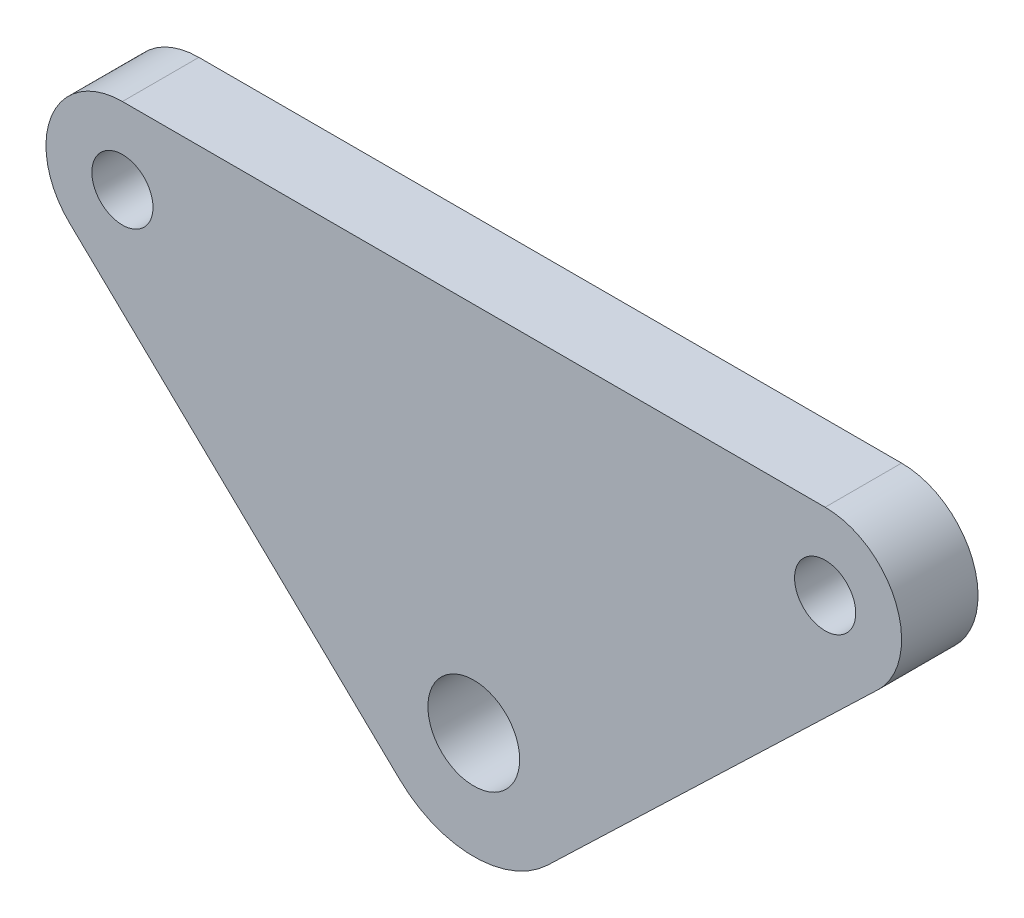
ISO-10303-21;
HEADER;
FILE_DESCRIPTION(('STEP AP214'),'2;1');
FILE_NAME('part.step','',(''),(''),'','','');
FILE_SCHEMA(('AUTOMOTIVE_DESIGN { 1 0 10303 214 1 1 1 1 }'));
ENDSEC;
DATA;
#1=APPLICATION_CONTEXT('core data for automotive mechanical design processes');
#2=APPLICATION_PROTOCOL_DEFINITION('international standard','automotive_design',2000,#1);
#3=PRODUCT_CONTEXT('',#1,'mechanical');
#4=PRODUCT('Part','Part','',(#3));
#5=PRODUCT_RELATED_PRODUCT_CATEGORY('part','',(#4));
#6=PRODUCT_DEFINITION_FORMATION('','',#4);
#7=PRODUCT_DEFINITION_CONTEXT('part definition',#1,'design');
#8=PRODUCT_DEFINITION('design','',#6,#7);
#9=PRODUCT_DEFINITION_SHAPE('','',#8);
#10=(LENGTH_UNIT() NAMED_UNIT(*) SI_UNIT(.MILLI.,.METRE.));
#11=(NAMED_UNIT(*) PLANE_ANGLE_UNIT() SI_UNIT($,.RADIAN.));
#12=(NAMED_UNIT(*) SI_UNIT($,.STERADIAN.) SOLID_ANGLE_UNIT());
#13=UNCERTAINTY_MEASURE_WITH_UNIT(LENGTH_MEASURE(1.E-05),#10,'distance_accuracy_value','');
#14=(GEOMETRIC_REPRESENTATION_CONTEXT(3) GLOBAL_UNCERTAINTY_ASSIGNED_CONTEXT((#13)) GLOBAL_UNIT_ASSIGNED_CONTEXT((#10,
#11,#12)) REPRESENTATION_CONTEXT('',''));
#15=CARTESIAN_POINT('',(0.,0.,0.));
#16=DIRECTION('',(0.,0.,1.));
#17=DIRECTION('',(1.,0.,0.));
#18=AXIS2_PLACEMENT_3D('',#15,#16,#17);
#19=CARTESIAN_POINT('',(-125.350212024943,156.268923770409,-15.));
#20=DIRECTION('',(0.,0.,1.));
#21=DIRECTION('',(1.,0.,0.));
#22=AXIS2_PLACEMENT_3D('',#19,#20,#21);
#23=CYLINDRICAL_SURFACE('',#22,5.00000000000001);
#24=CARTESIAN_POINT('',(-125.350212024943,156.268923770409,-10.));
#25=DIRECTION('',(0.,0.,1.));
#26=DIRECTION('',(1.,0.,0.));
#27=AXIS2_PLACEMENT_3D('',#24,#25,#26);
#28=CIRCLE('',#27,5.00000000000001);
#29=CARTESIAN_POINT('',(-125.350212024943,161.268923770409,-10.));
#30=VERTEX_POINT('',#29);
#31=CARTESIAN_POINT('',(-128.812348183196,152.661485174713,-10.));
#32=VERTEX_POINT('',#31);
#33=EDGE_CURVE('E118',#30,#32,#28,.T.);
#34=ORIENTED_EDGE('',*,*,#33,.F.);
#35=DIRECTION('',(0.,0.,1.));
#36=VECTOR('',#35,1.);
#37=CARTESIAN_POINT('',(-125.350212024943,161.268923770409,-15.));
#38=LINE('',#37,#36);
#39=CARTESIAN_POINT('',(-125.350212024943,161.268923770409,-15.));
#40=VERTEX_POINT('',#39);
#41=EDGE_CURVE('E11',#40,#30,#38,.T.);
#42=ORIENTED_EDGE('',*,*,#41,.F.);
#43=CARTESIAN_POINT('',(-125.350212024943,156.268923770409,-15.));
#44=DIRECTION('',(0.,0.,1.));
#45=DIRECTION('',(1.,0.,0.));
#46=AXIS2_PLACEMENT_3D('',#43,#44,#45);
#47=CIRCLE('',#46,5.00000000000001);
#48=CARTESIAN_POINT('',(-128.812348183196,152.661485174713,-15.));
#49=VERTEX_POINT('',#48);
#50=EDGE_CURVE('E133',#40,#49,#47,.T.);
#51=ORIENTED_EDGE('',*,*,#50,.T.);
#52=DIRECTION('',(0.,0.,1.));
#53=VECTOR('',#52,1.);
#54=CARTESIAN_POINT('',(-128.812348183196,152.661485174713,-15.));
#55=LINE('',#54,#53);
#56=EDGE_CURVE('E36',#49,#32,#55,.T.);
#57=ORIENTED_EDGE('',*,*,#56,.T.);
#58=EDGE_LOOP('',(#34,#42,#51,#57));
#59=FACE_BOUND('',#58,.T.);
#60=ADVANCED_FACE('F33',(#59),#23,.T.);
#61=CARTESIAN_POINT('',(-125.350212024943,161.268923770409,-15.));
#62=DIRECTION('',(0.,1.,0.));
#63=DIRECTION('',(-1.,0.,0.));
#64=AXIS2_PLACEMENT_3D('',#61,#62,#63);
#65=PLANE('',#64);
#66=DIRECTION('',(-1.,0.,0.));
#67=VECTOR('',#66,1.);
#68=CARTESIAN_POINT('',(-125.350212024943,161.268923770409,-10.));
#69=LINE('',#68,#67);
#70=CARTESIAN_POINT('',(-79.3875454378039,161.268923770408,-10.));
#71=VERTEX_POINT('',#70);
#72=EDGE_CURVE('E131',#71,#30,#69,.T.);
#73=ORIENTED_EDGE('',*,*,#72,.F.);
#74=DIRECTION('',(0.,0.,1.));
#75=VECTOR('',#74,1.);
#76=CARTESIAN_POINT('',(-79.3875454378039,161.268923770408,-15.));
#77=LINE('',#76,#75);
#78=CARTESIAN_POINT('',(-79.3875454378039,161.268923770408,-15.));
#79=VERTEX_POINT('',#78);
#80=EDGE_CURVE('E42',#79,#71,#77,.T.);
#81=ORIENTED_EDGE('',*,*,#80,.F.);
#82=DIRECTION('',(-1.,0.,0.));
#83=VECTOR('',#82,1.);
#84=CARTESIAN_POINT('',(-125.350212024943,161.268923770409,-15.));
#85=LINE('',#84,#83);
#86=EDGE_CURVE('E108',#79,#40,#85,.T.);
#87=ORIENTED_EDGE('',*,*,#86,.T.);
#88=ORIENTED_EDGE('',*,*,#41,.T.);
#89=EDGE_LOOP('',(#73,#81,#87,#88));
#90=FACE_BOUND('',#89,.T.);
#91=ADVANCED_FACE('F141',(#90),#65,.T.);
#92=CARTESIAN_POINT('',(-79.3875454378039,156.268923770408,-15.));
#93=DIRECTION('',(0.,0.,1.));
#94=DIRECTION('',(1.,0.,0.));
#95=AXIS2_PLACEMENT_3D('',#92,#93,#94);
#96=CYLINDRICAL_SURFACE('',#95,4.99999999999998);
#97=CARTESIAN_POINT('',(-79.3875454378039,156.268923770408,-10.));
#98=DIRECTION('',(0.,0.,1.));
#99=DIRECTION('',(1.,0.,0.));
#100=AXIS2_PLACEMENT_3D('',#97,#98,#99);
#101=CIRCLE('',#100,4.99999999999998);
#102=CARTESIAN_POINT('',(-75.9254092795504,152.661485174713,-10.));
#103=VERTEX_POINT('',#102);
#104=EDGE_CURVE('E95',#103,#71,#101,.T.);
#105=ORIENTED_EDGE('',*,*,#104,.F.);
#106=DIRECTION('',(0.,0.,1.));
#107=VECTOR('',#106,1.);
#108=CARTESIAN_POINT('',(-75.9254092795504,152.661485174713,-15.));
#109=LINE('',#108,#107);
#110=CARTESIAN_POINT('',(-75.9254092795504,152.661485174713,-15.));
#111=VERTEX_POINT('',#110);
#112=EDGE_CURVE('E90',#111,#103,#109,.T.);
#113=ORIENTED_EDGE('',*,*,#112,.F.);
#114=CARTESIAN_POINT('',(-79.3875454378039,156.268923770408,-15.));
#115=DIRECTION('',(0.,0.,1.));
#116=DIRECTION('',(1.,0.,0.));
#117=AXIS2_PLACEMENT_3D('',#114,#115,#116);
#118=CIRCLE('',#117,4.99999999999998);
#119=EDGE_CURVE('E93',#111,#79,#118,.T.);
#120=ORIENTED_EDGE('',*,*,#119,.T.);
#121=ORIENTED_EDGE('',*,*,#80,.T.);
#122=EDGE_LOOP('',(#105,#113,#120,#121));
#123=FACE_BOUND('',#122,.T.);
#124=ADVANCED_FACE('F92',(#123),#96,.T.);
#125=CARTESIAN_POINT('',(-75.9254092795504,152.661485174713,-15.));
#126=DIRECTION('',(0.692427231650704,-0.721487719139101,0.));
#127=DIRECTION('',(0.721487719139101,0.692427231650704,0.));
#128=AXIS2_PLACEMENT_3D('',#125,#126,#127);
#129=PLANE('',#128);
#130=DIRECTION('',(0.721487719139101,0.692427231650704,0.));
#131=VECTOR('',#130,1.);
#132=CARTESIAN_POINT('',(-75.9254092795504,152.661485174713,-10.));
#133=LINE('',#132,#131);
#134=CARTESIAN_POINT('',(-97.5218881098184,131.934881445839,-10.));
#135=VERTEX_POINT('',#134);
#136=EDGE_CURVE('E128',#135,#103,#133,.T.);
#137=ORIENTED_EDGE('',*,*,#136,.F.);
#138=DIRECTION('',(0.,0.,1.));
#139=VECTOR('',#138,1.);
#140=CARTESIAN_POINT('',(-97.5218881098184,131.934881445839,-15.));
#141=LINE('',#140,#139);
#142=CARTESIAN_POINT('',(-97.5218881098184,131.934881445839,-15.));
#143=VERTEX_POINT('',#142);
#144=EDGE_CURVE('E100',#143,#135,#141,.T.);
#145=ORIENTED_EDGE('',*,*,#144,.F.);
#146=DIRECTION('',(0.721487719139101,0.692427231650704,0.));
#147=VECTOR('',#146,1.);
#148=CARTESIAN_POINT('',(-75.9254092795504,152.661485174713,-15.));
#149=LINE('',#148,#147);
#150=EDGE_CURVE('E106',#143,#111,#149,.T.);
#151=ORIENTED_EDGE('',*,*,#150,.T.);
#152=ORIENTED_EDGE('',*,*,#112,.T.);
#153=EDGE_LOOP('',(#137,#145,#151,#152));
#154=FACE_BOUND('',#153,.T.);
#155=ADVANCED_FACE('F110',(#154),#129,.T.);
#156=CARTESIAN_POINT('',(-102.368878731373,136.985295479812,-15.));
#157=DIRECTION('',(0.,0.,1.));
#158=DIRECTION('',(1.,0.,0.));
#159=AXIS2_PLACEMENT_3D('',#156,#157,#158);
#160=CYLINDRICAL_SURFACE('',#159,7.00000000000001);
#161=CARTESIAN_POINT('',(-102.368878731373,136.985295479812,-10.));
#162=DIRECTION('',(0.,0.,1.));
#163=DIRECTION('',(1.,0.,0.));
#164=AXIS2_PLACEMENT_3D('',#161,#162,#163);
#165=CIRCLE('',#164,7.00000000000001);
#166=CARTESIAN_POINT('',(-107.215869352928,131.934881445839,-10.));
#167=VERTEX_POINT('',#166);
#168=EDGE_CURVE('E125',#167,#135,#165,.T.);
#169=ORIENTED_EDGE('',*,*,#168,.F.);
#170=DIRECTION('',(0.,0.,1.));
#171=VECTOR('',#170,1.);
#172=CARTESIAN_POINT('',(-107.215869352928,131.934881445839,-15.));
#173=LINE('',#172,#171);
#174=CARTESIAN_POINT('',(-107.215869352928,131.934881445839,-15.));
#175=VERTEX_POINT('',#174);
#176=EDGE_CURVE('E136',#175,#167,#173,.T.);
#177=ORIENTED_EDGE('',*,*,#176,.F.);
#178=CARTESIAN_POINT('',(-102.368878731373,136.985295479812,-15.));
#179=DIRECTION('',(0.,0.,1.));
#180=DIRECTION('',(1.,0.,0.));
#181=AXIS2_PLACEMENT_3D('',#178,#179,#180);
#182=CIRCLE('',#181,7.00000000000001);
#183=EDGE_CURVE('E111',#175,#143,#182,.T.);
#184=ORIENTED_EDGE('',*,*,#183,.T.);
#185=ORIENTED_EDGE('',*,*,#144,.T.);
#186=EDGE_LOOP('',(#169,#177,#184,#185));
#187=FACE_BOUND('',#186,.T.);
#188=ADVANCED_FACE('F154',(#187),#160,.T.);
#189=CARTESIAN_POINT('',(-128.812348183196,152.661485174713,-15.));
#190=DIRECTION('',(-0.692427231650708,-0.721487719139097,0.));
#191=DIRECTION('',(0.721487719139097,-0.692427231650708,0.));
#192=AXIS2_PLACEMENT_3D('',#189,#190,#191);
#193=PLANE('',#192);
#194=DIRECTION('',(0.721487719139097,-0.692427231650708,0.));
#195=VECTOR('',#194,1.);
#196=CARTESIAN_POINT('',(-128.812348183196,152.661485174713,-10.));
#197=LINE('',#196,#195);
#198=EDGE_CURVE('E121',#32,#167,#197,.T.);
#199=ORIENTED_EDGE('',*,*,#198,.F.);
#200=ORIENTED_EDGE('',*,*,#56,.F.);
#201=DIRECTION('',(0.721487719139097,-0.692427231650708,0.));
#202=VECTOR('',#201,1.);
#203=CARTESIAN_POINT('',(-128.812348183196,152.661485174713,-15.));
#204=LINE('',#203,#202);
#205=EDGE_CURVE('E113',#49,#175,#204,.T.);
#206=ORIENTED_EDGE('',*,*,#205,.T.);
#207=ORIENTED_EDGE('',*,*,#176,.T.);
#208=EDGE_LOOP('',(#199,#200,#206,#207));
#209=FACE_BOUND('',#208,.T.);
#210=ADVANCED_FACE('F138',(#209),#193,.T.);
#211=CARTESIAN_POINT('',(-125.350212024943,156.268923770409,-15.));
#212=DIRECTION('',(0.,0.,1.));
#213=DIRECTION('',(1.,0.,0.));
#214=AXIS2_PLACEMENT_3D('',#211,#212,#213);
#215=PLANE('',#214);
#216=CARTESIAN_POINT('',(-125.350212024943,156.268923770409,-15.));
#217=DIRECTION('',(0.,0.,1.));
#218=DIRECTION('',(1.,0.,0.));
#219=AXIS2_PLACEMENT_3D('',#216,#217,#218);
#220=CIRCLE('',#219,2.);
#221=CARTESIAN_POINT('',(-123.350212024943,156.268923770409,-15.));
#222=VERTEX_POINT('',#221);
#223=EDGE_CURVE('E184',#222,#222,#220,.T.);
#224=ORIENTED_EDGE('',*,*,#223,.T.);
#225=EDGE_LOOP('',(#224));
#226=FACE_BOUND('',#225,.T.);
#227=CARTESIAN_POINT('',(-79.3875454378039,156.268923770408,-15.));
#228=DIRECTION('',(0.,0.,1.));
#229=DIRECTION('',(1.,0.,0.));
#230=AXIS2_PLACEMENT_3D('',#227,#228,#229);
#231=CIRCLE('',#230,2.00000000000124);
#232=CARTESIAN_POINT('',(-77.3875454378027,156.268923770408,-15.));
#233=VERTEX_POINT('',#232);
#234=EDGE_CURVE('E192',#233,#233,#231,.T.);
#235=ORIENTED_EDGE('',*,*,#234,.T.);
#236=EDGE_LOOP('',(#235));
#237=FACE_BOUND('',#236,.T.);
#238=CARTESIAN_POINT('',(-102.368878731373,136.985295479812,-15.));
#239=DIRECTION('',(0.,0.,1.));
#240=DIRECTION('',(1.,0.,0.));
#241=AXIS2_PLACEMENT_3D('',#238,#239,#240);
#242=CIRCLE('',#241,3.00000000000115);
#243=CARTESIAN_POINT('',(-99.3688787313722,136.985295479812,-15.));
#244=VERTEX_POINT('',#243);
#245=EDGE_CURVE('E122',#244,#244,#242,.T.);
#246=ORIENTED_EDGE('',*,*,#245,.T.);
#247=EDGE_LOOP('',(#246));
#248=FACE_BOUND('',#247,.T.);
#249=ORIENTED_EDGE('',*,*,#50,.F.);
#250=ORIENTED_EDGE('',*,*,#86,.F.);
#251=ORIENTED_EDGE('',*,*,#119,.F.);
#252=ORIENTED_EDGE('',*,*,#150,.F.);
#253=ORIENTED_EDGE('',*,*,#183,.F.);
#254=ORIENTED_EDGE('',*,*,#205,.F.);
#255=EDGE_LOOP('',(#249,#250,#251,#252,#253,#254));
#256=FACE_BOUND('',#255,.T.);
#257=ADVANCED_FACE('F104',(#226,#237,#248,#256),#215,.F.);
#258=CARTESIAN_POINT('',(-125.350212024943,156.268923770409,-10.));
#259=DIRECTION('',(0.,0.,1.));
#260=DIRECTION('',(1.,0.,0.));
#261=AXIS2_PLACEMENT_3D('',#258,#259,#260);
#262=PLANE('',#261);
#263=CARTESIAN_POINT('',(-125.350212024943,156.268923770409,-10.));
#264=DIRECTION('',(0.,0.,1.));
#265=DIRECTION('',(1.,0.,0.));
#266=AXIS2_PLACEMENT_3D('',#263,#264,#265);
#267=CIRCLE('',#266,2.);
#268=CARTESIAN_POINT('',(-123.350212024943,156.268923770409,-10.));
#269=VERTEX_POINT('',#268);
#270=EDGE_CURVE('E187',#269,#269,#267,.T.);
#271=ORIENTED_EDGE('',*,*,#270,.F.);
#272=EDGE_LOOP('',(#271));
#273=FACE_BOUND('',#272,.T.);
#274=CARTESIAN_POINT('',(-79.3875454378039,156.268923770408,-10.));
#275=DIRECTION('',(0.,0.,1.));
#276=DIRECTION('',(1.,0.,0.));
#277=AXIS2_PLACEMENT_3D('',#274,#275,#276);
#278=CIRCLE('',#277,2.00000000000124);
#279=CARTESIAN_POINT('',(-77.3875454378027,156.268923770408,-10.));
#280=VERTEX_POINT('',#279);
#281=EDGE_CURVE('E189',#280,#280,#278,.T.);
#282=ORIENTED_EDGE('',*,*,#281,.F.);
#283=EDGE_LOOP('',(#282));
#284=FACE_BOUND('',#283,.T.);
#285=CARTESIAN_POINT('',(-102.368878731373,136.985295479812,-10.));
#286=DIRECTION('',(0.,0.,1.));
#287=DIRECTION('',(1.,0.,0.));
#288=AXIS2_PLACEMENT_3D('',#285,#286,#287);
#289=CIRCLE('',#288,3.00000000000115);
#290=CARTESIAN_POINT('',(-99.3688787313722,136.985295479812,-10.));
#291=VERTEX_POINT('',#290);
#292=EDGE_CURVE('E195',#291,#291,#289,.T.);
#293=ORIENTED_EDGE('',*,*,#292,.F.);
#294=EDGE_LOOP('',(#293));
#295=FACE_BOUND('',#294,.T.);
#296=ORIENTED_EDGE('',*,*,#33,.T.);
#297=ORIENTED_EDGE('',*,*,#198,.T.);
#298=ORIENTED_EDGE('',*,*,#168,.T.);
#299=ORIENTED_EDGE('',*,*,#136,.T.);
#300=ORIENTED_EDGE('',*,*,#104,.T.);
#301=ORIENTED_EDGE('',*,*,#72,.T.);
#302=EDGE_LOOP('',(#296,#297,#298,#299,#300,#301));
#303=FACE_BOUND('',#302,.T.);
#304=ADVANCED_FACE('F140',(#273,#284,#295,#303),#262,.T.);
#305=CARTESIAN_POINT('',(-102.368878731373,136.985295479812,-15.));
#306=DIRECTION('',(0.,0.,1.));
#307=DIRECTION('',(1.,0.,0.));
#308=AXIS2_PLACEMENT_3D('',#305,#306,#307);
#309=CYLINDRICAL_SURFACE('',#308,3.00000000000115);
#310=ORIENTED_EDGE('',*,*,#245,.F.);
#311=EDGE_LOOP('',(#310));
#312=FACE_BOUND('',#311,.T.);
#313=ORIENTED_EDGE('',*,*,#292,.T.);
#314=EDGE_LOOP('',(#313));
#315=FACE_BOUND('',#314,.T.);
#316=ADVANCED_FACE('F165',(#312,#315),#309,.F.);
#317=CARTESIAN_POINT('',(-79.3875454378039,156.268923770408,-15.));
#318=DIRECTION('',(0.,0.,1.));
#319=DIRECTION('',(1.,0.,0.));
#320=AXIS2_PLACEMENT_3D('',#317,#318,#319);
#321=CYLINDRICAL_SURFACE('',#320,2.00000000000124);
#322=ORIENTED_EDGE('',*,*,#234,.F.);
#323=EDGE_LOOP('',(#322));
#324=FACE_BOUND('',#323,.T.);
#325=ORIENTED_EDGE('',*,*,#281,.T.);
#326=EDGE_LOOP('',(#325));
#327=FACE_BOUND('',#326,.T.);
#328=ADVANCED_FACE('F172',(#324,#327),#321,.F.);
#329=CARTESIAN_POINT('',(-125.350212024943,156.268923770409,-15.));
#330=DIRECTION('',(0.,0.,1.));
#331=DIRECTION('',(1.,0.,0.));
#332=AXIS2_PLACEMENT_3D('',#329,#330,#331);
#333=CYLINDRICAL_SURFACE('',#332,2.);
#334=ORIENTED_EDGE('',*,*,#223,.F.);
#335=EDGE_LOOP('',(#334));
#336=FACE_BOUND('',#335,.T.);
#337=ORIENTED_EDGE('',*,*,#270,.T.);
#338=EDGE_LOOP('',(#337));
#339=FACE_BOUND('',#338,.T.);
#340=ADVANCED_FACE('F176',(#336,#339),#333,.F.);
#341=CLOSED_SHELL('',(#60,#91,#124,#155,#188,#210,#257,#304,#316,#328,#340));
#342=MANIFOLD_SOLID_BREP('B2',#341);
#343=ADVANCED_BREP_SHAPE_REPRESENTATION('',(#18,#342),#14);
#344=SHAPE_DEFINITION_REPRESENTATION(#9,#343);
ENDSEC;
END-ISO-10303-21;
